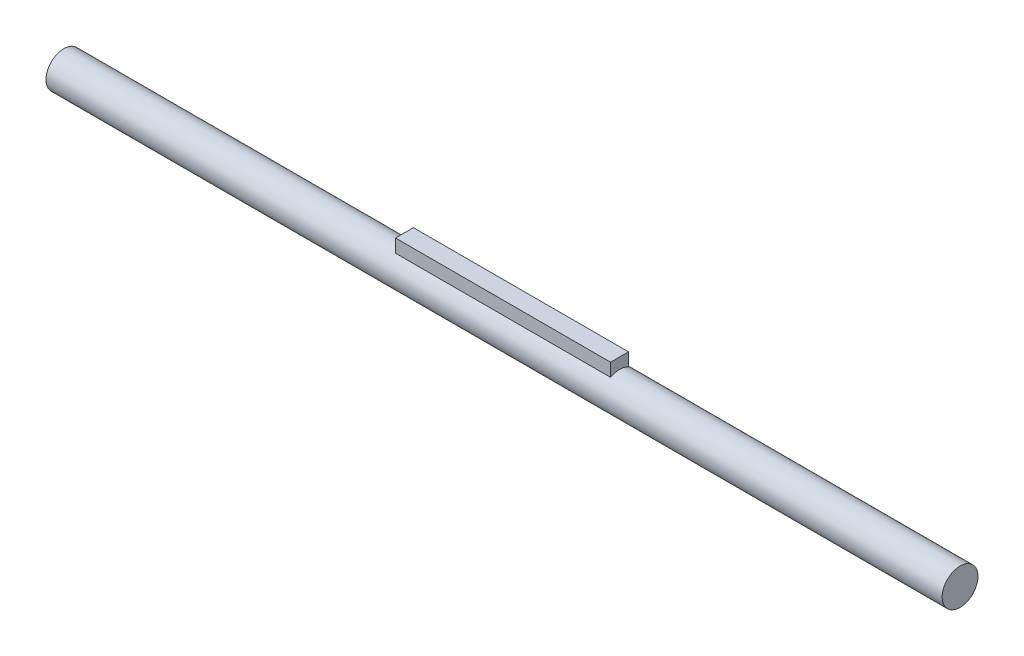
ISO-10303-21;
HEADER;
FILE_DESCRIPTION(('STEP AP214'),'2;1');
FILE_NAME('part.step','',(''),(''),'','','');
FILE_SCHEMA(('AUTOMOTIVE_DESIGN { 1 0 10303 214 1 1 1 1 }'));
ENDSEC;
DATA;
#1=APPLICATION_CONTEXT('core data for automotive mechanical design processes');
#2=APPLICATION_PROTOCOL_DEFINITION('international standard','automotive_design',2000,#1);
#3=PRODUCT_CONTEXT('',#1,'mechanical');
#4=PRODUCT('Part','Part','',(#3));
#5=PRODUCT_RELATED_PRODUCT_CATEGORY('part','',(#4));
#6=PRODUCT_DEFINITION_FORMATION('','',#4);
#7=PRODUCT_DEFINITION_CONTEXT('part definition',#1,'design');
#8=PRODUCT_DEFINITION('design','',#6,#7);
#9=PRODUCT_DEFINITION_SHAPE('','',#8);
#10=(LENGTH_UNIT() NAMED_UNIT(*) SI_UNIT(.MILLI.,.METRE.));
#11=(NAMED_UNIT(*) PLANE_ANGLE_UNIT() SI_UNIT($,.RADIAN.));
#12=(NAMED_UNIT(*) SI_UNIT($,.STERADIAN.) SOLID_ANGLE_UNIT());
#13=UNCERTAINTY_MEASURE_WITH_UNIT(LENGTH_MEASURE(1.E-05),#10,'distance_accuracy_value','');
#14=(GEOMETRIC_REPRESENTATION_CONTEXT(3) GLOBAL_UNCERTAINTY_ASSIGNED_CONTEXT((#13)) GLOBAL_UNIT_ASSIGNED_CONTEXT((#10,
#11,#12)) REPRESENTATION_CONTEXT('',''));
#15=CARTESIAN_POINT('',(0.,0.,0.));
#16=DIRECTION('',(0.,0.,1.));
#17=DIRECTION('',(1.,0.,0.));
#18=AXIS2_PLACEMENT_3D('',#15,#16,#17);
#19=CARTESIAN_POINT('',(-125.,0.,0.));
#20=DIRECTION('',(1.,0.,0.));
#21=DIRECTION('',(0.,0.,-1.));
#22=AXIS2_PLACEMENT_3D('',#19,#20,#21);
#23=CYLINDRICAL_SURFACE('',#22,5.);
#24=CARTESIAN_POINT('',(-125.,0.,0.));
#25=DIRECTION('',(1.,0.,0.));
#26=DIRECTION('',(0.,0.,-1.));
#27=AXIS2_PLACEMENT_3D('',#24,#25,#26);
#28=CIRCLE('',#27,5.);
#29=CARTESIAN_POINT('',(-125.,0.,-5.));
#30=VERTEX_POINT('',#29);
#31=EDGE_CURVE('E125',#30,#30,#28,.T.);
#32=ORIENTED_EDGE('',*,*,#31,.T.);
#33=EDGE_LOOP('',(#32));
#34=FACE_BOUND('',#33,.T.);
#35=CARTESIAN_POINT('',(125.,0.,0.));
#36=DIRECTION('',(1.,0.,0.));
#37=DIRECTION('',(0.,0.,-1.));
#38=AXIS2_PLACEMENT_3D('',#35,#36,#37);
#39=CIRCLE('',#38,5.);
#40=CARTESIAN_POINT('',(125.,0.,-5.));
#41=VERTEX_POINT('',#40);
#42=EDGE_CURVE('E120',#41,#41,#39,.T.);
#43=ORIENTED_EDGE('',*,*,#42,.F.);
#44=EDGE_LOOP('',(#43));
#45=FACE_BOUND('',#44,.T.);
#46=DIRECTION('',(1.,0.,0.));
#47=VECTOR('',#46,1.);
#48=CARTESIAN_POINT('',(-125.,4.33012701892219,2.5));
#49=LINE('',#48,#47);
#50=CARTESIAN_POINT('',(-30.,4.33012701892219,2.5));
#51=VERTEX_POINT('',#50);
#52=CARTESIAN_POINT('',(30.,4.33012701892219,2.5));
#53=VERTEX_POINT('',#52);
#54=EDGE_CURVE('E61',#51,#53,#49,.T.);
#55=ORIENTED_EDGE('',*,*,#54,.F.);
#56=CARTESIAN_POINT('',(-30.,0.,0.));
#57=DIRECTION('',(1.,0.,0.));
#58=DIRECTION('',(0.,0.,-1.));
#59=AXIS2_PLACEMENT_3D('',#56,#57,#58);
#60=CIRCLE('',#59,5.);
#61=CARTESIAN_POINT('',(-30.,4.33012701892219,-2.5));
#62=VERTEX_POINT('',#61);
#63=EDGE_CURVE('E11',#51,#62,#60,.F.);
#64=ORIENTED_EDGE('',*,*,#63,.T.);
#65=DIRECTION('',(1.,0.,0.));
#66=VECTOR('',#65,1.);
#67=CARTESIAN_POINT('',(-125.,4.33012701892219,-2.5));
#68=LINE('',#67,#66);
#69=CARTESIAN_POINT('',(30.,4.33012701892219,-2.5));
#70=VERTEX_POINT('',#69);
#71=EDGE_CURVE('E51',#70,#62,#68,.F.);
#72=ORIENTED_EDGE('',*,*,#71,.F.);
#73=CARTESIAN_POINT('',(30.,0.,0.));
#74=DIRECTION('',(1.,0.,0.));
#75=DIRECTION('',(0.,0.,-1.));
#76=AXIS2_PLACEMENT_3D('',#73,#74,#75);
#77=CIRCLE('',#76,5.);
#78=EDGE_CURVE('E88',#53,#70,#77,.F.);
#79=ORIENTED_EDGE('',*,*,#78,.F.);
#80=EDGE_LOOP('',(#55,#64,#72,#79));
#81=FACE_BOUND('',#80,.T.);
#82=ADVANCED_FACE('F43',(#34,#45,#81),#23,.T.);
#83=CARTESIAN_POINT('',(-125.,0.,0.));
#84=DIRECTION('',(1.,0.,0.));
#85=DIRECTION('',(0.,0.,-1.));
#86=AXIS2_PLACEMENT_3D('',#83,#84,#85);
#87=PLANE('',#86);
#88=ORIENTED_EDGE('',*,*,#31,.F.);
#89=EDGE_LOOP('',(#88));
#90=FACE_BOUND('',#89,.T.);
#91=ADVANCED_FACE('F149',(#90),#87,.F.);
#92=CARTESIAN_POINT('',(125.,0.,0.));
#93=DIRECTION('',(1.,0.,0.));
#94=DIRECTION('',(0.,0.,-1.));
#95=AXIS2_PLACEMENT_3D('',#92,#93,#94);
#96=PLANE('',#95);
#97=ORIENTED_EDGE('',*,*,#42,.T.);
#98=EDGE_LOOP('',(#97));
#99=FACE_BOUND('',#98,.T.);
#100=ADVANCED_FACE('F145',(#99),#96,.T.);
#101=CARTESIAN_POINT('',(-30.,8.,-2.5));
#102=DIRECTION('',(0.,0.,-1.));
#103=DIRECTION('',(0.,1.,0.));
#104=AXIS2_PLACEMENT_3D('',#101,#102,#103);
#105=PLANE('',#104);
#106=DIRECTION('',(0.,1.,0.));
#107=VECTOR('',#106,1.);
#108=CARTESIAN_POINT('',(30.,8.,-2.5));
#109=LINE('',#108,#107);
#110=CARTESIAN_POINT('',(30.,8.,-2.5));
#111=VERTEX_POINT('',#110);
#112=EDGE_CURVE('E81',#70,#111,#109,.T.);
#113=ORIENTED_EDGE('',*,*,#112,.F.);
#114=ORIENTED_EDGE('',*,*,#71,.T.);
#115=DIRECTION('',(0.,1.,0.));
#116=VECTOR('',#115,1.);
#117=CARTESIAN_POINT('',(-30.,8.,-2.5));
#118=LINE('',#117,#116);
#119=CARTESIAN_POINT('',(-30.,8.,-2.5));
#120=VERTEX_POINT('',#119);
#121=EDGE_CURVE('E96',#62,#120,#118,.T.);
#122=ORIENTED_EDGE('',*,*,#121,.T.);
#123=DIRECTION('',(1.,0.,0.));
#124=VECTOR('',#123,1.);
#125=CARTESIAN_POINT('',(-30.,8.,-2.5));
#126=LINE('',#125,#124);
#127=EDGE_CURVE('E93',#120,#111,#126,.T.);
#128=ORIENTED_EDGE('',*,*,#127,.T.);
#129=EDGE_LOOP('',(#113,#114,#122,#128));
#130=FACE_BOUND('',#129,.T.);
#131=ADVANCED_FACE('F94',(#130),#105,.T.);
#132=CARTESIAN_POINT('',(-30.,8.,2.5));
#133=DIRECTION('',(0.,0.,1.));
#134=DIRECTION('',(0.,-1.,0.));
#135=AXIS2_PLACEMENT_3D('',#132,#133,#134);
#136=PLANE('',#135);
#137=DIRECTION('',(0.,-1.,0.));
#138=VECTOR('',#137,1.);
#139=CARTESIAN_POINT('',(-30.,8.,2.5));
#140=LINE('',#139,#138);
#141=CARTESIAN_POINT('',(-30.,8.,2.5));
#142=VERTEX_POINT('',#141);
#143=EDGE_CURVE('E102',#142,#51,#140,.T.);
#144=ORIENTED_EDGE('',*,*,#143,.T.);
#145=ORIENTED_EDGE('',*,*,#54,.T.);
#146=DIRECTION('',(0.,-1.,0.));
#147=VECTOR('',#146,1.);
#148=CARTESIAN_POINT('',(30.,8.,2.5));
#149=LINE('',#148,#147);
#150=CARTESIAN_POINT('',(30.,8.,2.5));
#151=VERTEX_POINT('',#150);
#152=EDGE_CURVE('E106',#151,#53,#149,.T.);
#153=ORIENTED_EDGE('',*,*,#152,.F.);
#154=DIRECTION('',(1.,0.,0.));
#155=VECTOR('',#154,1.);
#156=CARTESIAN_POINT('',(-30.,8.,2.5));
#157=LINE('',#156,#155);
#158=EDGE_CURVE('E101',#142,#151,#157,.T.);
#159=ORIENTED_EDGE('',*,*,#158,.F.);
#160=EDGE_LOOP('',(#144,#145,#153,#159));
#161=FACE_BOUND('',#160,.T.);
#162=ADVANCED_FACE('F137',(#161),#136,.T.);
#163=CARTESIAN_POINT('',(-30.,8.,2.5));
#164=DIRECTION('',(0.,1.,0.));
#165=DIRECTION('',(0.,0.,1.));
#166=AXIS2_PLACEMENT_3D('',#163,#164,#165);
#167=PLANE('',#166);
#168=ORIENTED_EDGE('',*,*,#158,.T.);
#169=DIRECTION('',(0.,0.,1.));
#170=VECTOR('',#169,1.);
#171=CARTESIAN_POINT('',(30.,8.,2.5));
#172=LINE('',#171,#170);
#173=EDGE_CURVE('E86',#111,#151,#172,.T.);
#174=ORIENTED_EDGE('',*,*,#173,.F.);
#175=ORIENTED_EDGE('',*,*,#127,.F.);
#176=DIRECTION('',(0.,0.,1.));
#177=VECTOR('',#176,1.);
#178=CARTESIAN_POINT('',(-30.,8.,2.5));
#179=LINE('',#178,#177);
#180=EDGE_CURVE('E113',#120,#142,#179,.T.);
#181=ORIENTED_EDGE('',*,*,#180,.T.);
#182=EDGE_LOOP('',(#168,#174,#175,#181));
#183=FACE_BOUND('',#182,.T.);
#184=ADVANCED_FACE('F104',(#183),#167,.T.);
#185=CARTESIAN_POINT('',(-30.,0.,0.));
#186=DIRECTION('',(1.,0.,0.));
#187=DIRECTION('',(0.,0.,-1.));
#188=AXIS2_PLACEMENT_3D('',#185,#186,#187);
#189=PLANE('',#188);
#190=ORIENTED_EDGE('',*,*,#63,.F.);
#191=ORIENTED_EDGE('',*,*,#143,.F.);
#192=ORIENTED_EDGE('',*,*,#180,.F.);
#193=ORIENTED_EDGE('',*,*,#121,.F.);
#194=EDGE_LOOP('',(#190,#191,#192,#193));
#195=FACE_BOUND('',#194,.T.);
#196=ADVANCED_FACE('F134',(#195),#189,.F.);
#197=CARTESIAN_POINT('',(30.,0.,0.));
#198=DIRECTION('',(1.,0.,0.));
#199=DIRECTION('',(0.,0.,-1.));
#200=AXIS2_PLACEMENT_3D('',#197,#198,#199);
#201=PLANE('',#200);
#202=ORIENTED_EDGE('',*,*,#152,.T.);
#203=ORIENTED_EDGE('',*,*,#78,.T.);
#204=ORIENTED_EDGE('',*,*,#112,.T.);
#205=ORIENTED_EDGE('',*,*,#173,.T.);
#206=EDGE_LOOP('',(#202,#203,#204,#205));
#207=FACE_BOUND('',#206,.T.);
#208=ADVANCED_FACE('F84',(#207),#201,.T.);
#209=CLOSED_SHELL('',(#82,#91,#100,#131,#162,#184,#196,#208));
#210=MANIFOLD_SOLID_BREP('B2',#209);
#211=ADVANCED_BREP_SHAPE_REPRESENTATION('',(#18,#210),#14);
#212=SHAPE_DEFINITION_REPRESENTATION(#9,#211);
ENDSEC;
END-ISO-10303-21;
